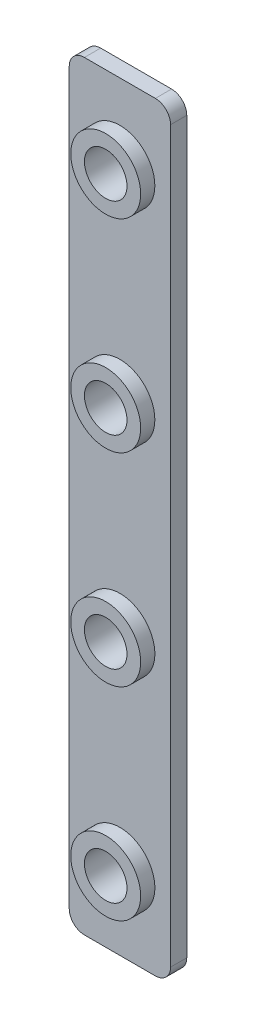
ISO-10303-21;
HEADER;
FILE_DESCRIPTION(('STEP AP214'),'2;1');
FILE_NAME('part.step','',(''),(''),'','','');
FILE_SCHEMA(('AUTOMOTIVE_DESIGN { 1 0 10303 214 1 1 1 1 }'));
ENDSEC;
DATA;
#1=APPLICATION_CONTEXT('core data for automotive mechanical design processes');
#2=APPLICATION_PROTOCOL_DEFINITION('international standard','automotive_design',2000,#1);
#3=PRODUCT_CONTEXT('',#1,'mechanical');
#4=PRODUCT('Part','Part','',(#3));
#5=PRODUCT_RELATED_PRODUCT_CATEGORY('part','',(#4));
#6=PRODUCT_DEFINITION_FORMATION('','',#4);
#7=PRODUCT_DEFINITION_CONTEXT('part definition',#1,'design');
#8=PRODUCT_DEFINITION('design','',#6,#7);
#9=PRODUCT_DEFINITION_SHAPE('','',#8);
#10=(LENGTH_UNIT() NAMED_UNIT(*) SI_UNIT(.MILLI.,.METRE.));
#11=(NAMED_UNIT(*) PLANE_ANGLE_UNIT() SI_UNIT($,.RADIAN.));
#12=(NAMED_UNIT(*) SI_UNIT($,.STERADIAN.) SOLID_ANGLE_UNIT());
#13=UNCERTAINTY_MEASURE_WITH_UNIT(LENGTH_MEASURE(1.E-05),#10,'distance_accuracy_value','');
#14=(GEOMETRIC_REPRESENTATION_CONTEXT(3) GLOBAL_UNCERTAINTY_ASSIGNED_CONTEXT((#13)) GLOBAL_UNIT_ASSIGNED_CONTEXT((#10,
#11,#12)) REPRESENTATION_CONTEXT('',''));
#15=CARTESIAN_POINT('',(0.,0.,0.));
#16=DIRECTION('',(0.,0.,1.));
#17=DIRECTION('',(1.,0.,0.));
#18=AXIS2_PLACEMENT_3D('',#15,#16,#17);
#19=CARTESIAN_POINT('',(3.5,-36.,1.6));
#20=DIRECTION('',(0.,0.,1.));
#21=DIRECTION('',(1.,0.,0.));
#22=AXIS2_PLACEMENT_3D('',#19,#20,#21);
#23=PLANE('',#22);
#24=CARTESIAN_POINT('',(0.,-10.,1.6));
#25=DIRECTION('',(0.,0.,1.));
#26=DIRECTION('',(-1.,0.,0.));
#27=AXIS2_PLACEMENT_3D('',#24,#25,#26);
#28=CIRCLE('',#27,3.45);
#29=CARTESIAN_POINT('',(-3.45,-10.,1.6));
#30=VERTEX_POINT('',#29);
#31=EDGE_CURVE('E192',#30,#30,#28,.T.);
#32=ORIENTED_EDGE('',*,*,#31,.F.);
#33=EDGE_LOOP('',(#32));
#34=FACE_BOUND('',#33,.T.);
#35=CARTESIAN_POINT('',(0.,10.,1.6));
#36=DIRECTION('',(0.,0.,1.));
#37=DIRECTION('',(1.,0.,0.));
#38=AXIS2_PLACEMENT_3D('',#35,#36,#37);
#39=CIRCLE('',#38,3.45);
#40=CARTESIAN_POINT('',(3.45,10.,1.6));
#41=VERTEX_POINT('',#40);
#42=EDGE_CURVE('E180',#41,#41,#39,.T.);
#43=ORIENTED_EDGE('',*,*,#42,.F.);
#44=EDGE_LOOP('',(#43));
#45=FACE_BOUND('',#44,.T.);
#46=CARTESIAN_POINT('',(3.5,-36.,1.6));
#47=DIRECTION('',(0.,0.,1.));
#48=DIRECTION('',(1.,0.,0.));
#49=AXIS2_PLACEMENT_3D('',#46,#47,#48);
#50=CIRCLE('',#49,1.5);
#51=CARTESIAN_POINT('',(3.49999999999999,-37.5,1.6));
#52=VERTEX_POINT('',#51);
#53=CARTESIAN_POINT('',(5.,-36.,1.6));
#54=VERTEX_POINT('',#53);
#55=EDGE_CURVE('E147',#52,#54,#50,.T.);
#56=ORIENTED_EDGE('',*,*,#55,.T.);
#57=DIRECTION('',(0.,1.,0.));
#58=VECTOR('',#57,1.);
#59=CARTESIAN_POINT('',(5.,-36.,1.6));
#60=LINE('',#59,#58);
#61=CARTESIAN_POINT('',(5.,36.,1.6));
#62=VERTEX_POINT('',#61);
#63=EDGE_CURVE('E95',#54,#62,#60,.T.);
#64=ORIENTED_EDGE('',*,*,#63,.T.);
#65=CARTESIAN_POINT('',(3.5,36.,1.6));
#66=DIRECTION('',(0.,0.,1.));
#67=DIRECTION('',(1.,0.,0.));
#68=AXIS2_PLACEMENT_3D('',#65,#66,#67);
#69=CIRCLE('',#68,1.5);
#70=CARTESIAN_POINT('',(3.5,37.5,1.6));
#71=VERTEX_POINT('',#70);
#72=EDGE_CURVE('E162',#62,#71,#69,.T.);
#73=ORIENTED_EDGE('',*,*,#72,.T.);
#74=DIRECTION('',(-1.,0.,0.));
#75=VECTOR('',#74,1.);
#76=CARTESIAN_POINT('',(3.5,37.5,1.6));
#77=LINE('',#76,#75);
#78=CARTESIAN_POINT('',(-3.49999999999999,37.5,1.6));
#79=VERTEX_POINT('',#78);
#80=EDGE_CURVE('E174',#71,#79,#77,.T.);
#81=ORIENTED_EDGE('',*,*,#80,.T.);
#82=CARTESIAN_POINT('',(-3.5,36.,1.6));
#83=DIRECTION('',(0.,0.,1.));
#84=DIRECTION('',(1.,0.,0.));
#85=AXIS2_PLACEMENT_3D('',#82,#83,#84);
#86=CIRCLE('',#85,1.5);
#87=CARTESIAN_POINT('',(-5.,36.,1.6));
#88=VERTEX_POINT('',#87);
#89=EDGE_CURVE('E114',#79,#88,#86,.T.);
#90=ORIENTED_EDGE('',*,*,#89,.T.);
#91=DIRECTION('',(0.,-1.,0.));
#92=VECTOR('',#91,1.);
#93=CARTESIAN_POINT('',(-5.,-36.,1.6));
#94=LINE('',#93,#92);
#95=CARTESIAN_POINT('',(-5.,-36.,1.6));
#96=VERTEX_POINT('',#95);
#97=EDGE_CURVE('E108',#88,#96,#94,.T.);
#98=ORIENTED_EDGE('',*,*,#97,.T.);
#99=CARTESIAN_POINT('',(-3.5,-36.,1.6));
#100=DIRECTION('',(0.,0.,1.));
#101=DIRECTION('',(-1.,0.,0.));
#102=AXIS2_PLACEMENT_3D('',#99,#100,#101);
#103=CIRCLE('',#102,1.5);
#104=CARTESIAN_POINT('',(-3.49999999999999,-37.5,1.6));
#105=VERTEX_POINT('',#104);
#106=EDGE_CURVE('E112',#96,#105,#103,.T.);
#107=ORIENTED_EDGE('',*,*,#106,.T.);
#108=DIRECTION('',(1.,0.,0.));
#109=VECTOR('',#108,1.);
#110=CARTESIAN_POINT('',(3.49999999999999,-37.5,1.6));
#111=LINE('',#110,#109);
#112=EDGE_CURVE('E52',#105,#52,#111,.T.);
#113=ORIENTED_EDGE('',*,*,#112,.T.);
#114=EDGE_LOOP('',(#56,#64,#73,#81,#90,#98,#107,#113));
#115=FACE_BOUND('',#114,.T.);
#116=CARTESIAN_POINT('',(0.,30.,1.6));
#117=DIRECTION('',(0.,0.,1.));
#118=DIRECTION('',(1.,0.,0.));
#119=AXIS2_PLACEMENT_3D('',#116,#117,#118);
#120=CIRCLE('',#119,3.45);
#121=CARTESIAN_POINT('',(3.45,30.,1.6));
#122=VERTEX_POINT('',#121);
#123=EDGE_CURVE('E186',#122,#122,#120,.T.);
#124=ORIENTED_EDGE('',*,*,#123,.F.);
#125=EDGE_LOOP('',(#124));
#126=FACE_BOUND('',#125,.T.);
#127=CARTESIAN_POINT('',(0.,-30.,1.6));
#128=DIRECTION('',(0.,0.,1.));
#129=DIRECTION('',(-1.,0.,0.));
#130=AXIS2_PLACEMENT_3D('',#127,#128,#129);
#131=CIRCLE('',#130,3.45);
#132=CARTESIAN_POINT('',(-3.45,-30.,1.6));
#133=VERTEX_POINT('',#132);
#134=EDGE_CURVE('E198',#133,#133,#131,.T.);
#135=ORIENTED_EDGE('',*,*,#134,.F.);
#136=EDGE_LOOP('',(#135));
#137=FACE_BOUND('',#136,.T.);
#138=ADVANCED_FACE('F35',(#34,#45,#115,#126,#137),#23,.T.);
#139=CARTESIAN_POINT('',(3.5,-36.,1.6));
#140=DIRECTION('',(0.,0.,-1.));
#141=DIRECTION('',(-1.,0.,0.));
#142=AXIS2_PLACEMENT_3D('',#139,#140,#141);
#143=CYLINDRICAL_SURFACE('',#142,1.5);
#144=CARTESIAN_POINT('',(3.5,-36.,0.));
#145=DIRECTION('',(0.,0.,1.));
#146=DIRECTION('',(1.,0.,0.));
#147=AXIS2_PLACEMENT_3D('',#144,#145,#146);
#148=CIRCLE('',#147,1.5);
#149=CARTESIAN_POINT('',(3.49999999999999,-37.5,0.));
#150=VERTEX_POINT('',#149);
#151=CARTESIAN_POINT('',(5.,-36.,0.));
#152=VERTEX_POINT('',#151);
#153=EDGE_CURVE('E132',#150,#152,#148,.T.);
#154=ORIENTED_EDGE('',*,*,#153,.T.);
#155=DIRECTION('',(0.,0.,-1.));
#156=VECTOR('',#155,1.);
#157=CARTESIAN_POINT('',(5.,-36.,1.6));
#158=LINE('',#157,#156);
#159=EDGE_CURVE('E11',#54,#152,#158,.T.);
#160=ORIENTED_EDGE('',*,*,#159,.F.);
#161=ORIENTED_EDGE('',*,*,#55,.F.);
#162=DIRECTION('',(0.,0.,-1.));
#163=VECTOR('',#162,1.);
#164=CARTESIAN_POINT('',(3.49999999999999,-37.5,1.6));
#165=LINE('',#164,#163);
#166=EDGE_CURVE('E128',#52,#150,#165,.T.);
#167=ORIENTED_EDGE('',*,*,#166,.T.);
#168=EDGE_LOOP('',(#154,#160,#161,#167));
#169=FACE_BOUND('',#168,.T.);
#170=ADVANCED_FACE('F37',(#169),#143,.T.);
#171=CARTESIAN_POINT('',(5.,-36.,1.6));
#172=DIRECTION('',(-1.,0.,0.));
#173=DIRECTION('',(0.,0.,1.));
#174=AXIS2_PLACEMENT_3D('',#171,#172,#173);
#175=PLANE('',#174);
#176=DIRECTION('',(0.,1.,0.));
#177=VECTOR('',#176,1.);
#178=CARTESIAN_POINT('',(5.,-36.,0.));
#179=LINE('',#178,#177);
#180=CARTESIAN_POINT('',(5.,36.,0.));
#181=VERTEX_POINT('',#180);
#182=EDGE_CURVE('E135',#152,#181,#179,.T.);
#183=ORIENTED_EDGE('',*,*,#182,.T.);
#184=DIRECTION('',(0.,0.,-1.));
#185=VECTOR('',#184,1.);
#186=CARTESIAN_POINT('',(5.,36.,1.6));
#187=LINE('',#186,#185);
#188=EDGE_CURVE('E44',#62,#181,#187,.T.);
#189=ORIENTED_EDGE('',*,*,#188,.F.);
#190=ORIENTED_EDGE('',*,*,#63,.F.);
#191=ORIENTED_EDGE('',*,*,#159,.T.);
#192=EDGE_LOOP('',(#183,#189,#190,#191));
#193=FACE_BOUND('',#192,.T.);
#194=ADVANCED_FACE('F292',(#193),#175,.F.);
#195=CARTESIAN_POINT('',(3.5,36.,1.6));
#196=DIRECTION('',(0.,0.,-1.));
#197=DIRECTION('',(-1.,0.,0.));
#198=AXIS2_PLACEMENT_3D('',#195,#196,#197);
#199=CYLINDRICAL_SURFACE('',#198,1.5);
#200=CARTESIAN_POINT('',(3.5,36.,0.));
#201=DIRECTION('',(0.,0.,1.));
#202=DIRECTION('',(1.,0.,0.));
#203=AXIS2_PLACEMENT_3D('',#200,#201,#202);
#204=CIRCLE('',#203,1.5);
#205=CARTESIAN_POINT('',(3.5,37.5,0.));
#206=VERTEX_POINT('',#205);
#207=EDGE_CURVE('E138',#181,#206,#204,.T.);
#208=ORIENTED_EDGE('',*,*,#207,.T.);
#209=DIRECTION('',(0.,0.,-1.));
#210=VECTOR('',#209,1.);
#211=CARTESIAN_POINT('',(3.5,37.5,1.6));
#212=LINE('',#211,#210);
#213=EDGE_CURVE('E154',#71,#206,#212,.T.);
#214=ORIENTED_EDGE('',*,*,#213,.F.);
#215=ORIENTED_EDGE('',*,*,#72,.F.);
#216=ORIENTED_EDGE('',*,*,#188,.T.);
#217=EDGE_LOOP('',(#208,#214,#215,#216));
#218=FACE_BOUND('',#217,.T.);
#219=ADVANCED_FACE('F160',(#218),#199,.T.);
#220=CARTESIAN_POINT('',(3.5,37.5,1.6));
#221=DIRECTION('',(0.,-1.,0.));
#222=DIRECTION('',(1.,0.,0.));
#223=AXIS2_PLACEMENT_3D('',#220,#221,#222);
#224=PLANE('',#223);
#225=DIRECTION('',(-1.,0.,0.));
#226=VECTOR('',#225,1.);
#227=CARTESIAN_POINT('',(3.5,37.5,0.));
#228=LINE('',#227,#226);
#229=CARTESIAN_POINT('',(-3.49999999999999,37.5,0.));
#230=VERTEX_POINT('',#229);
#231=EDGE_CURVE('E140',#206,#230,#228,.T.);
#232=ORIENTED_EDGE('',*,*,#231,.T.);
#233=DIRECTION('',(0.,0.,-1.));
#234=VECTOR('',#233,1.);
#235=CARTESIAN_POINT('',(-3.49999999999999,37.5,1.6));
#236=LINE('',#235,#234);
#237=EDGE_CURVE('E151',#79,#230,#236,.T.);
#238=ORIENTED_EDGE('',*,*,#237,.F.);
#239=ORIENTED_EDGE('',*,*,#80,.F.);
#240=ORIENTED_EDGE('',*,*,#213,.T.);
#241=EDGE_LOOP('',(#232,#238,#239,#240));
#242=FACE_BOUND('',#241,.T.);
#243=ADVANCED_FACE('F170',(#242),#224,.F.);
#244=CARTESIAN_POINT('',(-3.5,36.,1.6));
#245=DIRECTION('',(0.,0.,-1.));
#246=DIRECTION('',(-1.,0.,0.));
#247=AXIS2_PLACEMENT_3D('',#244,#245,#246);
#248=CYLINDRICAL_SURFACE('',#247,1.5);
#249=CARTESIAN_POINT('',(-3.5,36.,0.));
#250=DIRECTION('',(0.,0.,1.));
#251=DIRECTION('',(1.,0.,0.));
#252=AXIS2_PLACEMENT_3D('',#249,#250,#251);
#253=CIRCLE('',#252,1.5);
#254=CARTESIAN_POINT('',(-5.,36.,0.));
#255=VERTEX_POINT('',#254);
#256=EDGE_CURVE('E142',#230,#255,#253,.T.);
#257=ORIENTED_EDGE('',*,*,#256,.T.);
#258=DIRECTION('',(0.,0.,-1.));
#259=VECTOR('',#258,1.);
#260=CARTESIAN_POINT('',(-5.,36.,1.6));
#261=LINE('',#260,#259);
#262=EDGE_CURVE('E123',#88,#255,#261,.T.);
#263=ORIENTED_EDGE('',*,*,#262,.F.);
#264=ORIENTED_EDGE('',*,*,#89,.F.);
#265=ORIENTED_EDGE('',*,*,#237,.T.);
#266=EDGE_LOOP('',(#257,#263,#264,#265));
#267=FACE_BOUND('',#266,.T.);
#268=ADVANCED_FACE('F173',(#267),#248,.T.);
#269=CARTESIAN_POINT('',(-5.,-36.,1.6));
#270=DIRECTION('',(1.,0.,0.));
#271=DIRECTION('',(0.,0.,-1.));
#272=AXIS2_PLACEMENT_3D('',#269,#270,#271);
#273=PLANE('',#272);
#274=DIRECTION('',(0.,-1.,0.));
#275=VECTOR('',#274,1.);
#276=CARTESIAN_POINT('',(-5.,-36.,0.));
#277=LINE('',#276,#275);
#278=CARTESIAN_POINT('',(-5.,-36.,0.));
#279=VERTEX_POINT('',#278);
#280=EDGE_CURVE('E122',#255,#279,#277,.T.);
#281=ORIENTED_EDGE('',*,*,#280,.T.);
#282=DIRECTION('',(0.,0.,-1.));
#283=VECTOR('',#282,1.);
#284=CARTESIAN_POINT('',(-5.,-36.,1.6));
#285=LINE('',#284,#283);
#286=EDGE_CURVE('E119',#96,#279,#285,.T.);
#287=ORIENTED_EDGE('',*,*,#286,.F.);
#288=ORIENTED_EDGE('',*,*,#97,.F.);
#289=ORIENTED_EDGE('',*,*,#262,.T.);
#290=EDGE_LOOP('',(#281,#287,#288,#289));
#291=FACE_BOUND('',#290,.T.);
#292=ADVANCED_FACE('F120',(#291),#273,.F.);
#293=CARTESIAN_POINT('',(-3.5,-36.,1.6));
#294=DIRECTION('',(0.,0.,-1.));
#295=DIRECTION('',(-1.,0.,0.));
#296=AXIS2_PLACEMENT_3D('',#293,#294,#295);
#297=CYLINDRICAL_SURFACE('',#296,1.5);
#298=CARTESIAN_POINT('',(-3.5,-36.,0.));
#299=DIRECTION('',(0.,0.,1.));
#300=DIRECTION('',(-1.,0.,0.));
#301=AXIS2_PLACEMENT_3D('',#298,#299,#300);
#302=CIRCLE('',#301,1.5);
#303=CARTESIAN_POINT('',(-3.49999999999999,-37.5,0.));
#304=VERTEX_POINT('',#303);
#305=EDGE_CURVE('E81',#279,#304,#302,.T.);
#306=ORIENTED_EDGE('',*,*,#305,.T.);
#307=DIRECTION('',(0.,0.,-1.));
#308=VECTOR('',#307,1.);
#309=CARTESIAN_POINT('',(-3.49999999999999,-37.5,1.6));
#310=LINE('',#309,#308);
#311=EDGE_CURVE('E124',#105,#304,#310,.T.);
#312=ORIENTED_EDGE('',*,*,#311,.F.);
#313=ORIENTED_EDGE('',*,*,#106,.F.);
#314=ORIENTED_EDGE('',*,*,#286,.T.);
#315=EDGE_LOOP('',(#306,#312,#313,#314));
#316=FACE_BOUND('',#315,.T.);
#317=ADVANCED_FACE('F126',(#316),#297,.T.);
#318=CARTESIAN_POINT('',(3.49999999999999,-37.5,1.6));
#319=DIRECTION('',(0.,1.,0.));
#320=DIRECTION('',(-1.,0.,0.));
#321=AXIS2_PLACEMENT_3D('',#318,#319,#320);
#322=PLANE('',#321);
#323=DIRECTION('',(1.,0.,0.));
#324=VECTOR('',#323,1.);
#325=CARTESIAN_POINT('',(3.49999999999999,-37.5,0.));
#326=LINE('',#325,#324);
#327=EDGE_CURVE('E87',#304,#150,#326,.T.);
#328=ORIENTED_EDGE('',*,*,#327,.T.);
#329=ORIENTED_EDGE('',*,*,#166,.F.);
#330=ORIENTED_EDGE('',*,*,#112,.F.);
#331=ORIENTED_EDGE('',*,*,#311,.T.);
#332=EDGE_LOOP('',(#328,#329,#330,#331));
#333=FACE_BOUND('',#332,.T.);
#334=ADVANCED_FACE('F279',(#333),#322,.F.);
#335=CARTESIAN_POINT('',(3.5,-36.,0.));
#336=DIRECTION('',(0.,0.,1.));
#337=DIRECTION('',(1.,0.,0.));
#338=AXIS2_PLACEMENT_3D('',#335,#336,#337);
#339=PLANE('',#338);
#340=CARTESIAN_POINT('',(0.,30.,0.));
#341=DIRECTION('',(0.,0.,1.));
#342=DIRECTION('',(1.,0.,0.));
#343=AXIS2_PLACEMENT_3D('',#340,#341,#342);
#344=CIRCLE('',#343,2.1);
#345=CARTESIAN_POINT('',(2.1,30.,0.));
#346=VERTEX_POINT('',#345);
#347=EDGE_CURVE('E221',#346,#346,#344,.T.);
#348=ORIENTED_EDGE('',*,*,#347,.T.);
#349=EDGE_LOOP('',(#348));
#350=FACE_BOUND('',#349,.T.);
#351=CARTESIAN_POINT('',(0.,10.,0.));
#352=DIRECTION('',(0.,0.,1.));
#353=DIRECTION('',(1.,0.,0.));
#354=AXIS2_PLACEMENT_3D('',#351,#352,#353);
#355=CIRCLE('',#354,2.1);
#356=CARTESIAN_POINT('',(2.1,10.,0.));
#357=VERTEX_POINT('',#356);
#358=EDGE_CURVE('E215',#357,#357,#355,.T.);
#359=ORIENTED_EDGE('',*,*,#358,.T.);
#360=EDGE_LOOP('',(#359));
#361=FACE_BOUND('',#360,.T.);
#362=CARTESIAN_POINT('',(0.,-10.,0.));
#363=DIRECTION('',(0.,0.,1.));
#364=DIRECTION('',(1.,0.,0.));
#365=AXIS2_PLACEMENT_3D('',#362,#363,#364);
#366=CIRCLE('',#365,2.1);
#367=CARTESIAN_POINT('',(2.1,-10.,0.));
#368=VERTEX_POINT('',#367);
#369=EDGE_CURVE('E209',#368,#368,#366,.T.);
#370=ORIENTED_EDGE('',*,*,#369,.T.);
#371=EDGE_LOOP('',(#370));
#372=FACE_BOUND('',#371,.T.);
#373=CARTESIAN_POINT('',(0.,-30.,0.));
#374=DIRECTION('',(0.,0.,1.));
#375=DIRECTION('',(1.,0.,0.));
#376=AXIS2_PLACEMENT_3D('',#373,#374,#375);
#377=CIRCLE('',#376,2.1);
#378=CARTESIAN_POINT('',(2.1,-30.,0.));
#379=VERTEX_POINT('',#378);
#380=EDGE_CURVE('E201',#379,#379,#377,.T.);
#381=ORIENTED_EDGE('',*,*,#380,.T.);
#382=EDGE_LOOP('',(#381));
#383=FACE_BOUND('',#382,.T.);
#384=ORIENTED_EDGE('',*,*,#153,.F.);
#385=ORIENTED_EDGE('',*,*,#327,.F.);
#386=ORIENTED_EDGE('',*,*,#305,.F.);
#387=ORIENTED_EDGE('',*,*,#280,.F.);
#388=ORIENTED_EDGE('',*,*,#256,.F.);
#389=ORIENTED_EDGE('',*,*,#231,.F.);
#390=ORIENTED_EDGE('',*,*,#207,.F.);
#391=ORIENTED_EDGE('',*,*,#182,.F.);
#392=EDGE_LOOP('',(#384,#385,#386,#387,#388,#389,#390,#391));
#393=FACE_BOUND('',#392,.T.);
#394=ADVANCED_FACE('F166',(#350,#361,#372,#383,#393),#339,.F.);
#395=CARTESIAN_POINT('',(0.,10.,3.));
#396=DIRECTION('',(0.,0.,-1.));
#397=DIRECTION('',(-1.,0.,0.));
#398=AXIS2_PLACEMENT_3D('',#395,#396,#397);
#399=CYLINDRICAL_SURFACE('',#398,3.45);
#400=CARTESIAN_POINT('',(0.,10.,3.));
#401=DIRECTION('',(0.,0.,1.));
#402=DIRECTION('',(1.,0.,0.));
#403=AXIS2_PLACEMENT_3D('',#400,#401,#402);
#404=CIRCLE('',#403,3.45);
#405=CARTESIAN_POINT('',(3.45,10.,3.));
#406=VERTEX_POINT('',#405);
#407=EDGE_CURVE('E136',#406,#406,#404,.T.);
#408=ORIENTED_EDGE('',*,*,#407,.F.);
#409=EDGE_LOOP('',(#408));
#410=FACE_BOUND('',#409,.T.);
#411=ORIENTED_EDGE('',*,*,#42,.T.);
#412=EDGE_LOOP('',(#411));
#413=FACE_BOUND('',#412,.T.);
#414=ADVANCED_FACE('F272',(#410,#413),#399,.T.);
#415=CARTESIAN_POINT('',(0.,10.,3.));
#416=DIRECTION('',(0.,0.,1.));
#417=DIRECTION('',(1.,0.,0.));
#418=AXIS2_PLACEMENT_3D('',#415,#416,#417);
#419=PLANE('',#418);
#420=CARTESIAN_POINT('',(0.,10.,3.));
#421=DIRECTION('',(0.,0.,1.));
#422=DIRECTION('',(1.,0.,0.));
#423=AXIS2_PLACEMENT_3D('',#420,#421,#422);
#424=CIRCLE('',#423,2.1);
#425=CARTESIAN_POINT('',(2.1,10.,3.));
#426=VERTEX_POINT('',#425);
#427=EDGE_CURVE('E218',#426,#426,#424,.T.);
#428=ORIENTED_EDGE('',*,*,#427,.F.);
#429=EDGE_LOOP('',(#428));
#430=FACE_BOUND('',#429,.T.);
#431=ORIENTED_EDGE('',*,*,#407,.T.);
#432=EDGE_LOOP('',(#431));
#433=FACE_BOUND('',#432,.T.);
#434=ADVANCED_FACE('F240',(#430,#433),#419,.T.);
#435=CARTESIAN_POINT('',(0.,30.,3.));
#436=DIRECTION('',(0.,0.,-1.));
#437=DIRECTION('',(-1.,0.,0.));
#438=AXIS2_PLACEMENT_3D('',#435,#436,#437);
#439=CYLINDRICAL_SURFACE('',#438,3.45);
#440=CARTESIAN_POINT('',(0.,30.,3.));
#441=DIRECTION('',(0.,0.,1.));
#442=DIRECTION('',(1.,0.,0.));
#443=AXIS2_PLACEMENT_3D('',#440,#441,#442);
#444=CIRCLE('',#443,3.45);
#445=CARTESIAN_POINT('',(3.45,30.,3.));
#446=VERTEX_POINT('',#445);
#447=EDGE_CURVE('E183',#446,#446,#444,.T.);
#448=ORIENTED_EDGE('',*,*,#447,.F.);
#449=EDGE_LOOP('',(#448));
#450=FACE_BOUND('',#449,.T.);
#451=ORIENTED_EDGE('',*,*,#123,.T.);
#452=EDGE_LOOP('',(#451));
#453=FACE_BOUND('',#452,.T.);
#454=ADVANCED_FACE('F234',(#450,#453),#439,.T.);
#455=CARTESIAN_POINT('',(0.,30.,3.));
#456=DIRECTION('',(0.,0.,1.));
#457=DIRECTION('',(1.,0.,0.));
#458=AXIS2_PLACEMENT_3D('',#455,#456,#457);
#459=PLANE('',#458);
#460=CARTESIAN_POINT('',(0.,30.,3.));
#461=DIRECTION('',(0.,0.,1.));
#462=DIRECTION('',(1.,0.,0.));
#463=AXIS2_PLACEMENT_3D('',#460,#461,#462);
#464=CIRCLE('',#463,2.1);
#465=CARTESIAN_POINT('',(2.1,30.,3.));
#466=VERTEX_POINT('',#465);
#467=EDGE_CURVE('E224',#466,#466,#464,.T.);
#468=ORIENTED_EDGE('',*,*,#467,.F.);
#469=EDGE_LOOP('',(#468));
#470=FACE_BOUND('',#469,.T.);
#471=ORIENTED_EDGE('',*,*,#447,.T.);
#472=EDGE_LOOP('',(#471));
#473=FACE_BOUND('',#472,.T.);
#474=ADVANCED_FACE('F230',(#470,#473),#459,.T.);
#475=CARTESIAN_POINT('',(0.,-10.,3.));
#476=DIRECTION('',(0.,0.,-1.));
#477=DIRECTION('',(-1.,0.,0.));
#478=AXIS2_PLACEMENT_3D('',#475,#476,#477);
#479=CYLINDRICAL_SURFACE('',#478,3.45);
#480=CARTESIAN_POINT('',(0.,-10.,3.));
#481=DIRECTION('',(0.,0.,1.));
#482=DIRECTION('',(-1.,0.,0.));
#483=AXIS2_PLACEMENT_3D('',#480,#481,#482);
#484=CIRCLE('',#483,3.45);
#485=CARTESIAN_POINT('',(-3.45,-10.,3.));
#486=VERTEX_POINT('',#485);
#487=EDGE_CURVE('E189',#486,#486,#484,.T.);
#488=ORIENTED_EDGE('',*,*,#487,.F.);
#489=EDGE_LOOP('',(#488));
#490=FACE_BOUND('',#489,.T.);
#491=ORIENTED_EDGE('',*,*,#31,.T.);
#492=EDGE_LOOP('',(#491));
#493=FACE_BOUND('',#492,.T.);
#494=ADVANCED_FACE('F233',(#490,#493),#479,.T.);
#495=CARTESIAN_POINT('',(0.,-10.,3.));
#496=DIRECTION('',(0.,0.,-1.));
#497=DIRECTION('',(-1.,0.,0.));
#498=AXIS2_PLACEMENT_3D('',#495,#496,#497);
#499=PLANE('',#498);
#500=CARTESIAN_POINT('',(0.,-10.,3.));
#501=DIRECTION('',(0.,0.,1.));
#502=DIRECTION('',(1.,0.,0.));
#503=AXIS2_PLACEMENT_3D('',#500,#501,#502);
#504=CIRCLE('',#503,2.1);
#505=CARTESIAN_POINT('',(2.1,-10.,3.));
#506=VERTEX_POINT('',#505);
#507=EDGE_CURVE('E212',#506,#506,#504,.T.);
#508=ORIENTED_EDGE('',*,*,#507,.F.);
#509=EDGE_LOOP('',(#508));
#510=FACE_BOUND('',#509,.T.);
#511=ORIENTED_EDGE('',*,*,#487,.T.);
#512=EDGE_LOOP('',(#511));
#513=FACE_BOUND('',#512,.T.);
#514=ADVANCED_FACE('F252',(#510,#513),#499,.F.);
#515=CARTESIAN_POINT('',(0.,-30.,3.));
#516=DIRECTION('',(0.,0.,-1.));
#517=DIRECTION('',(-1.,0.,0.));
#518=AXIS2_PLACEMENT_3D('',#515,#516,#517);
#519=CYLINDRICAL_SURFACE('',#518,3.45);
#520=CARTESIAN_POINT('',(0.,-30.,3.));
#521=DIRECTION('',(0.,0.,1.));
#522=DIRECTION('',(-1.,0.,0.));
#523=AXIS2_PLACEMENT_3D('',#520,#521,#522);
#524=CIRCLE('',#523,3.45);
#525=CARTESIAN_POINT('',(-3.45,-30.,3.));
#526=VERTEX_POINT('',#525);
#527=EDGE_CURVE('E195',#526,#526,#524,.T.);
#528=ORIENTED_EDGE('',*,*,#527,.F.);
#529=EDGE_LOOP('',(#528));
#530=FACE_BOUND('',#529,.T.);
#531=ORIENTED_EDGE('',*,*,#134,.T.);
#532=EDGE_LOOP('',(#531));
#533=FACE_BOUND('',#532,.T.);
#534=ADVANCED_FACE('F249',(#530,#533),#519,.T.);
#535=CARTESIAN_POINT('',(0.,-30.,3.));
#536=DIRECTION('',(0.,0.,-1.));
#537=DIRECTION('',(-1.,0.,0.));
#538=AXIS2_PLACEMENT_3D('',#535,#536,#537);
#539=PLANE('',#538);
#540=CARTESIAN_POINT('',(0.,-30.,3.));
#541=DIRECTION('',(0.,0.,1.));
#542=DIRECTION('',(1.,0.,0.));
#543=AXIS2_PLACEMENT_3D('',#540,#541,#542);
#544=CIRCLE('',#543,2.1);
#545=CARTESIAN_POINT('',(2.1,-30.,3.));
#546=VERTEX_POINT('',#545);
#547=EDGE_CURVE('E206',#546,#546,#544,.T.);
#548=ORIENTED_EDGE('',*,*,#547,.F.);
#549=EDGE_LOOP('',(#548));
#550=FACE_BOUND('',#549,.T.);
#551=ORIENTED_EDGE('',*,*,#527,.T.);
#552=EDGE_LOOP('',(#551));
#553=FACE_BOUND('',#552,.T.);
#554=ADVANCED_FACE('F251',(#550,#553),#539,.F.);
#555=CARTESIAN_POINT('',(0.,-30.,3.));
#556=DIRECTION('',(0.,0.,1.));
#557=DIRECTION('',(1.,0.,0.));
#558=AXIS2_PLACEMENT_3D('',#555,#556,#557);
#559=CYLINDRICAL_SURFACE('',#558,2.1);
#560=ORIENTED_EDGE('',*,*,#380,.F.);
#561=EDGE_LOOP('',(#560));
#562=FACE_BOUND('',#561,.T.);
#563=ORIENTED_EDGE('',*,*,#547,.T.);
#564=EDGE_LOOP('',(#563));
#565=FACE_BOUND('',#564,.T.);
#566=ADVANCED_FACE('F259',(#562,#565),#559,.F.);
#567=CARTESIAN_POINT('',(0.,-10.,3.));
#568=DIRECTION('',(0.,0.,1.));
#569=DIRECTION('',(1.,0.,0.));
#570=AXIS2_PLACEMENT_3D('',#567,#568,#569);
#571=CYLINDRICAL_SURFACE('',#570,2.1);
#572=ORIENTED_EDGE('',*,*,#369,.F.);
#573=EDGE_LOOP('',(#572));
#574=FACE_BOUND('',#573,.T.);
#575=ORIENTED_EDGE('',*,*,#507,.T.);
#576=EDGE_LOOP('',(#575));
#577=FACE_BOUND('',#576,.T.);
#578=ADVANCED_FACE('F372',(#574,#577),#571,.F.);
#579=CARTESIAN_POINT('',(0.,10.,3.));
#580=DIRECTION('',(0.,0.,1.));
#581=DIRECTION('',(1.,0.,0.));
#582=AXIS2_PLACEMENT_3D('',#579,#580,#581);
#583=CYLINDRICAL_SURFACE('',#582,2.1);
#584=ORIENTED_EDGE('',*,*,#358,.F.);
#585=EDGE_LOOP('',(#584));
#586=FACE_BOUND('',#585,.T.);
#587=ORIENTED_EDGE('',*,*,#427,.T.);
#588=EDGE_LOOP('',(#587));
#589=FACE_BOUND('',#588,.T.);
#590=ADVANCED_FACE('F382',(#586,#589),#583,.F.);
#591=CARTESIAN_POINT('',(0.,30.,3.));
#592=DIRECTION('',(0.,0.,1.));
#593=DIRECTION('',(1.,0.,0.));
#594=AXIS2_PLACEMENT_3D('',#591,#592,#593);
#595=CYLINDRICAL_SURFACE('',#594,2.1);
#596=ORIENTED_EDGE('',*,*,#347,.F.);
#597=EDGE_LOOP('',(#596));
#598=FACE_BOUND('',#597,.T.);
#599=ORIENTED_EDGE('',*,*,#467,.T.);
#600=EDGE_LOOP('',(#599));
#601=FACE_BOUND('',#600,.T.);
#602=ADVANCED_FACE('F228',(#598,#601),#595,.F.);
#603=CLOSED_SHELL('',(#138,#170,#194,#219,#243,#268,#292,#317,#334,#394,#414,#434,#454,#474,
#494,#514,#534,#554,#566,#578,#590,#602));
#604=MANIFOLD_SOLID_BREP('B2',#603);
#605=ADVANCED_BREP_SHAPE_REPRESENTATION('',(#18,#604),#14);
#606=SHAPE_DEFINITION_REPRESENTATION(#9,#605);
ENDSEC;
END-ISO-10303-21;
